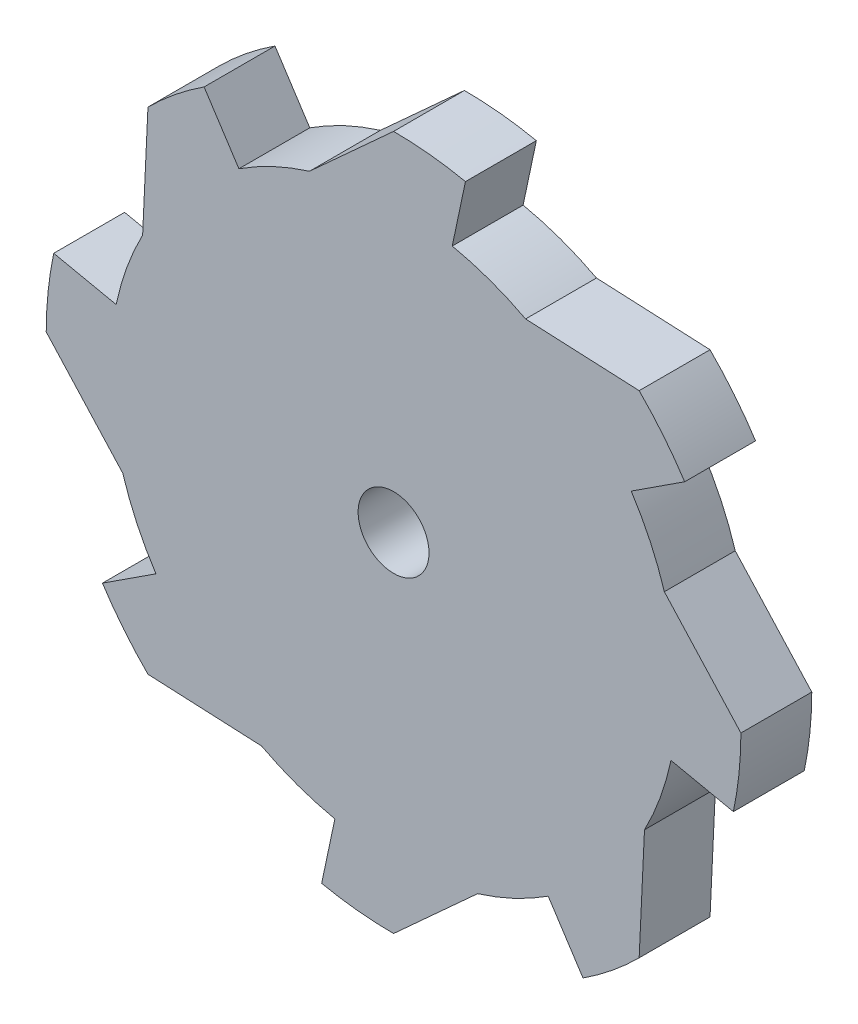
ISO-10303-21;
HEADER;
FILE_DESCRIPTION(('STEP AP214'),'2;1');
FILE_NAME('part.step','',(''),(''),'','','');
FILE_SCHEMA(('AUTOMOTIVE_DESIGN { 1 0 10303 214 1 1 1 1 }'));
ENDSEC;
DATA;
#1=APPLICATION_CONTEXT('core data for automotive mechanical design processes');
#2=APPLICATION_PROTOCOL_DEFINITION('international standard','automotive_design',2000,#1);
#3=PRODUCT_CONTEXT('',#1,'mechanical');
#4=PRODUCT('Part','Part','',(#3));
#5=PRODUCT_RELATED_PRODUCT_CATEGORY('part','',(#4));
#6=PRODUCT_DEFINITION_FORMATION('','',#4);
#7=PRODUCT_DEFINITION_CONTEXT('part definition',#1,'design');
#8=PRODUCT_DEFINITION('design','',#6,#7);
#9=PRODUCT_DEFINITION_SHAPE('','',#8);
#10=(LENGTH_UNIT() NAMED_UNIT(*) SI_UNIT(.MILLI.,.METRE.));
#11=(NAMED_UNIT(*) PLANE_ANGLE_UNIT() SI_UNIT($,.RADIAN.));
#12=(NAMED_UNIT(*) SI_UNIT($,.STERADIAN.) SOLID_ANGLE_UNIT());
#13=UNCERTAINTY_MEASURE_WITH_UNIT(LENGTH_MEASURE(1.E-05),#10,'distance_accuracy_value','');
#14=(GEOMETRIC_REPRESENTATION_CONTEXT(3) GLOBAL_UNCERTAINTY_ASSIGNED_CONTEXT((#13)) GLOBAL_UNIT_ASSIGNED_CONTEXT((#10,
#11,#12)) REPRESENTATION_CONTEXT('',''));
#15=CARTESIAN_POINT('',(0.,0.,0.));
#16=DIRECTION('',(0.,0.,1.));
#17=DIRECTION('',(1.,0.,0.));
#18=AXIS2_PLACEMENT_3D('',#15,#16,#17);
#19=CARTESIAN_POINT('',(0.,0.,20.));
#20=DIRECTION('',(0.,0.,-1.));
#21=DIRECTION('',(-1.,0.,0.));
#22=AXIS2_PLACEMENT_3D('',#19,#20,#21);
#23=CYLINDRICAL_SURFACE('',#22,98.);
#24=CARTESIAN_POINT('',(0.,0.,0.));
#25=DIRECTION('',(0.,0.,1.));
#26=DIRECTION('',(1.,0.,0.));
#27=AXIS2_PLACEMENT_3D('',#24,#25,#26);
#28=CIRCLE('',#27,98.);
#29=CARTESIAN_POINT('',(98.,0.,0.));
#30=VERTEX_POINT('',#29);
#31=CARTESIAN_POINT('',(95.8779684758264,-20.2833715379971,0.));
#32=VERTEX_POINT('',#31);
#33=EDGE_CURVE('E566',#30,#32,#28,.F.);
#34=ORIENTED_EDGE('',*,*,#33,.F.);
#35=DIRECTION('',(0.,0.,-1.));
#36=VECTOR('',#35,1.);
#37=CARTESIAN_POINT('',(98.,0.,20.));
#38=LINE('',#37,#36);
#39=CARTESIAN_POINT('',(98.,0.,20.));
#40=VERTEX_POINT('',#39);
#41=EDGE_CURVE('E11',#40,#30,#38,.T.);
#42=ORIENTED_EDGE('',*,*,#41,.F.);
#43=CARTESIAN_POINT('',(0.,0.,20.));
#44=DIRECTION('',(0.,0.,1.));
#45=DIRECTION('',(1.,0.,0.));
#46=AXIS2_PLACEMENT_3D('',#43,#44,#45);
#47=CIRCLE('',#46,98.);
#48=CARTESIAN_POINT('',(95.8779684758264,-20.2833715379971,20.));
#49=VERTEX_POINT('',#48);
#50=EDGE_CURVE('E567',#40,#49,#47,.F.);
#51=ORIENTED_EDGE('',*,*,#50,.T.);
#52=DIRECTION('',(0.,0.,-1.));
#53=VECTOR('',#52,1.);
#54=CARTESIAN_POINT('',(95.8779684758264,-20.2833715379971,20.));
#55=LINE('',#54,#53);
#56=EDGE_CURVE('E58',#49,#32,#55,.T.);
#57=ORIENTED_EDGE('',*,*,#56,.T.);
#58=EDGE_LOOP('',(#34,#42,#51,#57));
#59=FACE_BOUND('',#58,.T.);
#60=ADVANCED_FACE('F40',(#59),#23,.T.);
#61=CARTESIAN_POINT('',(53.5820749293354,48.7852907067484,20.));
#62=DIRECTION('',(0.739429419637785,0.673234085125024,0.));
#63=DIRECTION('',(-0.673234085125024,0.739429419637785,0.));
#64=AXIS2_PLACEMENT_3D('',#61,#62,#63);
#65=PLANE('',#64);
#66=DIRECTION('',(0.673234085125024,-0.739429419637785,0.));
#67=VECTOR('',#66,1.);
#68=CARTESIAN_POINT('',(53.5820749293354,48.7852907067484,0.));
#69=LINE('',#68,#67);
#70=CARTESIAN_POINT('',(76.4021946540973,23.7213965026815,0.));
#71=VERTEX_POINT('',#70);
#72=EDGE_CURVE('E583',#71,#30,#69,.T.);
#73=ORIENTED_EDGE('',*,*,#72,.F.);
#74=DIRECTION('',(0.,0.,-1.));
#75=VECTOR('',#74,1.);
#76=CARTESIAN_POINT('',(76.4021946540973,23.7213965026815,20.));
#77=LINE('',#76,#75);
#78=CARTESIAN_POINT('',(76.4021946540976,23.7213965026804,20.));
#79=VERTEX_POINT('',#78);
#80=EDGE_CURVE('E50',#79,#71,#77,.T.);
#81=ORIENTED_EDGE('',*,*,#80,.F.);
#82=DIRECTION('',(0.673234085125024,-0.739429419637785,0.));
#83=VECTOR('',#82,1.);
#84=CARTESIAN_POINT('',(53.5820749293354,48.7852907067484,20.));
#85=LINE('',#84,#83);
#86=EDGE_CURVE('E570',#79,#40,#85,.T.);
#87=ORIENTED_EDGE('',*,*,#86,.T.);
#88=ORIENTED_EDGE('',*,*,#41,.T.);
#89=EDGE_LOOP('',(#73,#81,#87,#88));
#90=FACE_BOUND('',#89,.T.);
#91=ADVANCED_FACE('F610',(#90),#65,.T.);
#92=CARTESIAN_POINT('',(0.,0.,20.));
#93=DIRECTION('',(0.,0.,-1.));
#94=DIRECTION('',(-1.,0.,0.));
#95=AXIS2_PLACEMENT_3D('',#92,#93,#94);
#96=CYLINDRICAL_SURFACE('',#95,80.);
#97=CARTESIAN_POINT('',(0.,0.,0.));
#98=DIRECTION('',(0.,0.,1.));
#99=DIRECTION('',(1.,0.,0.));
#100=AXIS2_PLACEMENT_3D('',#97,#98,#99);
#101=CIRCLE('',#100,80.);
#102=CARTESIAN_POINT('',(70.7980702637076,-37.250949611186,0.));
#103=VERTEX_POINT('',#102);
#104=CARTESIAN_POINT('',(78.2677293680216,-16.5578543167324,0.));
#105=VERTEX_POINT('',#104);
#106=EDGE_CURVE('E587',#103,#105,#101,.T.);
#107=ORIENTED_EDGE('',*,*,#106,.T.);
#108=DIRECTION('',(0.,0.,-1.));
#109=VECTOR('',#108,1.);
#110=CARTESIAN_POINT('',(78.2677293680216,-16.5578543167324,20.));
#111=LINE('',#110,#109);
#112=CARTESIAN_POINT('',(78.2677293680216,-16.5578543167324,20.));
#113=VERTEX_POINT('',#112);
#114=EDGE_CURVE('E73',#113,#105,#111,.T.);
#115=ORIENTED_EDGE('',*,*,#114,.F.);
#116=CARTESIAN_POINT('',(0.,0.,20.));
#117=DIRECTION('',(0.,0.,1.));
#118=DIRECTION('',(1.,0.,0.));
#119=AXIS2_PLACEMENT_3D('',#116,#117,#118);
#120=CIRCLE('',#119,80.);
#121=CARTESIAN_POINT('',(70.7980702637076,-37.250949611186,20.));
#122=VERTEX_POINT('',#121);
#123=EDGE_CURVE('E575',#122,#113,#120,.T.);
#124=ORIENTED_EDGE('',*,*,#123,.F.);
#125=DIRECTION('',(0.,0.,-1.));
#126=VECTOR('',#125,1.);
#127=CARTESIAN_POINT('',(70.7980702637076,-37.250949611186,20.));
#128=LINE('',#127,#126);
#129=EDGE_CURVE('E597',#122,#103,#128,.T.);
#130=ORIENTED_EDGE('',*,*,#129,.T.);
#131=EDGE_LOOP('',(#107,#115,#124,#130));
#132=FACE_BOUND('',#131,.T.);
#133=ADVANCED_FACE('F631',(#132),#96,.T.);
#134=CARTESIAN_POINT('',(0.,0.,20.));
#135=DIRECTION('',(-0.206973178959154,-0.97834661710027,0.));
#136=DIRECTION('',(0.97834661710027,-0.206973178959154,0.));
#137=AXIS2_PLACEMENT_3D('',#134,#135,#136);
#138=PLANE('',#137);
#139=DIRECTION('',(-0.97834661710027,0.206973178959154,0.));
#140=VECTOR('',#139,1.);
#141=CARTESIAN_POINT('',(0.,0.,0.));
#142=LINE('',#141,#140);
#143=EDGE_CURVE('E571',#32,#105,#142,.T.);
#144=ORIENTED_EDGE('',*,*,#143,.F.);
#145=ORIENTED_EDGE('',*,*,#56,.F.);
#146=DIRECTION('',(-0.97834661710027,0.206973178959154,0.));
#147=VECTOR('',#146,1.);
#148=CARTESIAN_POINT('',(0.,0.,20.));
#149=LINE('',#148,#147);
#150=EDGE_CURVE('E578',#49,#113,#149,.T.);
#151=ORIENTED_EDGE('',*,*,#150,.T.);
#152=ORIENTED_EDGE('',*,*,#114,.T.);
#153=EDGE_LOOP('',(#144,#145,#151,#152));
#154=FACE_BOUND('',#153,.T.);
#155=ADVANCED_FACE('F635',(#154),#138,.T.);
#156=CARTESIAN_POINT('',(0.,0.,20.));
#157=DIRECTION('',(0.,0.,1.));
#158=DIRECTION('',(1.,0.,0.));
#159=AXIS2_PLACEMENT_3D('',#156,#157,#158);
#160=PLANE('',#159);
#161=CARTESIAN_POINT('',(0.,0.,20.));
#162=DIRECTION('',(0.,0.,1.));
#163=DIRECTION('',(1.,0.,0.));
#164=AXIS2_PLACEMENT_3D('',#161,#162,#163);
#165=CIRCLE('',#164,10.);
#166=CARTESIAN_POINT('',(10.,0.,20.));
#167=VERTEX_POINT('',#166);
#168=EDGE_CURVE('E294',#167,#167,#165,.F.);
#169=ORIENTED_EDGE('',*,*,#168,.T.);
#170=EDGE_LOOP('',(#169));
#171=FACE_BOUND('',#170,.T.);
#172=DIRECTION('',(-0.0468071699168871,-0.998903943752537,0.));
#173=VECTOR('',#172,1.);
#174=CARTESIAN_POINT('',(72.3846584134777,-3.39183865168004,20.));
#175=LINE('',#174,#173);
#176=CARTESIAN_POINT('',(69.2964645562815,-69.2964645562818,20.));
#177=VERTEX_POINT('',#176);
#178=EDGE_CURVE('E527',#122,#177,#175,.T.);
#179=ORIENTED_EDGE('',*,*,#178,.F.);
#180=ORIENTED_EDGE('',*,*,#123,.T.);
#181=ORIENTED_EDGE('',*,*,#150,.F.);
#182=ORIENTED_EDGE('',*,*,#50,.F.);
#183=ORIENTED_EDGE('',*,*,#86,.F.);
#184=CARTESIAN_POINT('',(0.,0.,20.));
#185=DIRECTION('',(0.,0.,1.));
#186=DIRECTION('',(0.707106781186556,0.707106781186539,0.));
#187=AXIS2_PLACEMENT_3D('',#184,#185,#186);
#188=CIRCLE('',#187,80.);
#189=CARTESIAN_POINT('',(67.0518132534625,43.6354711149403,20.));
#190=VERTEX_POINT('',#189);
#191=EDGE_CURVE('E282',#79,#190,#188,.T.);
#192=ORIENTED_EDGE('',*,*,#191,.T.);
#193=DIRECTION('',(-0.838147665668281,-0.545443388936754,0.));
#194=VECTOR('',#193,1.);
#195=CARTESIAN_POINT('',(0.,0.,20.));
#196=LINE('',#195,#194);
#197=CARTESIAN_POINT('',(82.1384712354915,53.4534521158019,20.));
#198=VERTEX_POINT('',#197);
#199=EDGE_CURVE('E274',#198,#190,#196,.T.);
#200=ORIENTED_EDGE('',*,*,#199,.F.);
#201=CARTESIAN_POINT('',(0.,0.,20.));
#202=DIRECTION('',(0.,0.,1.));
#203=DIRECTION('',(0.707106781186556,0.707106781186539,0.));
#204=AXIS2_PLACEMENT_3D('',#201,#202,#203);
#205=CIRCLE('',#204,98.);
#206=CARTESIAN_POINT('',(69.2964645562825,69.2964645562808,20.));
#207=VERTEX_POINT('',#206);
#208=EDGE_CURVE('E256',#207,#198,#205,.F.);
#209=ORIENTED_EDGE('',*,*,#208,.F.);
#210=DIRECTION('',(0.998903943752537,-0.0468071699168974,0.));
#211=VECTOR('',#210,1.);
#212=CARTESIAN_POINT('',(3.39183865168079,72.3846584134776,20.));
#213=LINE('',#212,#211);
#214=CARTESIAN_POINT('',(37.2509496111868,70.7980702637072,20.));
#215=VERTEX_POINT('',#214);
#216=EDGE_CURVE('E272',#215,#207,#213,.T.);
#217=ORIENTED_EDGE('',*,*,#216,.F.);
#218=CARTESIAN_POINT('',(0.,0.,20.));
#219=DIRECTION('',(0.,0.,1.));
#220=DIRECTION('',(0.,1.,0.));
#221=AXIS2_PLACEMENT_3D('',#218,#219,#220);
#222=CIRCLE('',#221,80.);
#223=CARTESIAN_POINT('',(16.5578543167332,78.2677293680214,20.));
#224=VERTEX_POINT('',#223);
#225=EDGE_CURVE('E317',#215,#224,#222,.T.);
#226=ORIENTED_EDGE('',*,*,#225,.T.);
#227=DIRECTION('',(-0.206973178959165,-0.978346617100268,0.));
#228=VECTOR('',#227,1.);
#229=CARTESIAN_POINT('',(0.,0.,20.));
#230=LINE('',#229,#228);
#231=CARTESIAN_POINT('',(20.2833715379981,95.8779684758262,20.));
#232=VERTEX_POINT('',#231);
#233=EDGE_CURVE('E320',#232,#224,#230,.T.);
#234=ORIENTED_EDGE('',*,*,#233,.F.);
#235=CARTESIAN_POINT('',(0.,0.,20.));
#236=DIRECTION('',(0.,0.,1.));
#237=DIRECTION('',(0.,1.,0.));
#238=AXIS2_PLACEMENT_3D('',#235,#236,#237);
#239=CIRCLE('',#238,98.);
#240=CARTESIAN_POINT('',(1.03343440752379E-12,98.,20.));
#241=VERTEX_POINT('',#240);
#242=EDGE_CURVE('E308',#241,#232,#239,.F.);
#243=ORIENTED_EDGE('',*,*,#242,.F.);
#244=DIRECTION('',(0.739429419637792,0.673234085125016,0.));
#245=VECTOR('',#244,1.);
#246=CARTESIAN_POINT('',(-48.7852907067479,53.5820749293359,20.));
#247=LINE('',#246,#245);
#248=CARTESIAN_POINT('',(-23.7213965026806,76.4021946540975,20.));
#249=VERTEX_POINT('',#248);
#250=EDGE_CURVE('E312',#249,#241,#247,.T.);
#251=ORIENTED_EDGE('',*,*,#250,.F.);
#252=CARTESIAN_POINT('',(0.,0.,20.));
#253=DIRECTION('',(0.,0.,1.));
#254=DIRECTION('',(-0.707106781186541,0.707106781186554,0.));
#255=AXIS2_PLACEMENT_3D('',#252,#253,#254);
#256=CIRCLE('',#255,80.);
#257=CARTESIAN_POINT('',(-43.6354711149406,67.0518132534623,20.));
#258=VERTEX_POINT('',#257);
#259=EDGE_CURVE('E359',#249,#258,#256,.T.);
#260=ORIENTED_EDGE('',*,*,#259,.T.);
#261=DIRECTION('',(0.545443388936757,-0.838147665668279,0.));
#262=VECTOR('',#261,1.);
#263=CARTESIAN_POINT('',(0.,0.,20.));
#264=LINE('',#263,#262);
#265=CARTESIAN_POINT('',(-53.4534521158022,82.1384712354913,20.));
#266=VERTEX_POINT('',#265);
#267=EDGE_CURVE('E362',#266,#258,#264,.T.);
#268=ORIENTED_EDGE('',*,*,#267,.F.);
#269=CARTESIAN_POINT('',(0.,0.,20.));
#270=DIRECTION('',(0.,0.,1.));
#271=DIRECTION('',(-0.707106781186541,0.707106781186554,0.));
#272=AXIS2_PLACEMENT_3D('',#269,#270,#271);
#273=CIRCLE('',#272,98.);
#274=CARTESIAN_POINT('',(-69.2964645562811,69.2964645562823,20.));
#275=VERTEX_POINT('',#274);
#276=EDGE_CURVE('E350',#275,#266,#273,.F.);
#277=ORIENTED_EDGE('',*,*,#276,.F.);
#278=DIRECTION('',(0.046807169916894,0.998903943752537,0.));
#279=VECTOR('',#278,1.);
#280=CARTESIAN_POINT('',(-72.3846584134776,3.39183865168054,20.));
#281=LINE('',#280,#279);
#282=CARTESIAN_POINT('',(-70.7980702637076,37.250949611186,20.));
#283=VERTEX_POINT('',#282);
#284=EDGE_CURVE('E354',#283,#275,#281,.T.);
#285=ORIENTED_EDGE('',*,*,#284,.F.);
#286=CARTESIAN_POINT('',(0.,0.,20.));
#287=DIRECTION('',(0.,0.,1.));
#288=DIRECTION('',(-1.,0.,0.));
#289=AXIS2_PLACEMENT_3D('',#286,#287,#288);
#290=CIRCLE('',#289,80.);
#291=CARTESIAN_POINT('',(-78.2677293680216,16.5578543167324,20.));
#292=VERTEX_POINT('',#291);
#293=EDGE_CURVE('E402',#283,#292,#290,.T.);
#294=ORIENTED_EDGE('',*,*,#293,.T.);
#295=DIRECTION('',(0.97834661710027,-0.206973178959154,0.));
#296=VECTOR('',#295,1.);
#297=CARTESIAN_POINT('',(0.,0.,20.));
#298=LINE('',#297,#296);
#299=CARTESIAN_POINT('',(-95.8779684758264,20.2833715379971,20.));
#300=VERTEX_POINT('',#299);
#301=EDGE_CURVE('E405',#300,#292,#298,.T.);
#302=ORIENTED_EDGE('',*,*,#301,.F.);
#303=CARTESIAN_POINT('',(0.,0.,20.));
#304=DIRECTION('',(0.,0.,1.));
#305=DIRECTION('',(-1.,0.,0.));
#306=AXIS2_PLACEMENT_3D('',#303,#304,#305);
#307=CIRCLE('',#306,98.);
#308=CARTESIAN_POINT('',(-98.,0.,20.));
#309=VERTEX_POINT('',#308);
#310=EDGE_CURVE('E393',#309,#300,#307,.F.);
#311=ORIENTED_EDGE('',*,*,#310,.F.);
#312=DIRECTION('',(-0.673234085125024,0.739429419637785,0.));
#313=VECTOR('',#312,1.);
#314=CARTESIAN_POINT('',(-53.5820749293354,-48.7852907067484,20.));
#315=LINE('',#314,#313);
#316=CARTESIAN_POINT('',(-76.4021946540974,-23.7213965026809,20.));
#317=VERTEX_POINT('',#316);
#318=EDGE_CURVE('E397',#317,#309,#315,.T.);
#319=ORIENTED_EDGE('',*,*,#318,.F.);
#320=CARTESIAN_POINT('',(0.,0.,20.));
#321=DIRECTION('',(0.,0.,1.));
#322=DIRECTION('',(-0.707106781186551,-0.707106781186544,0.));
#323=AXIS2_PLACEMENT_3D('',#320,#321,#322);
#324=CIRCLE('',#323,80.);
#325=CARTESIAN_POINT('',(-67.0518132534622,-43.6354711149408,20.));
#326=VERTEX_POINT('',#325);
#327=EDGE_CURVE('E445',#317,#326,#324,.T.);
#328=ORIENTED_EDGE('',*,*,#327,.T.);
#329=DIRECTION('',(0.838147665668277,0.54544338893676,0.));
#330=VECTOR('',#329,1.);
#331=CARTESIAN_POINT('',(0.,0.,20.));
#332=LINE('',#331,#330);
#333=CARTESIAN_POINT('',(-82.1384712354912,-53.4534521158025,20.));
#334=VERTEX_POINT('',#333);
#335=EDGE_CURVE('E448',#334,#326,#332,.T.);
#336=ORIENTED_EDGE('',*,*,#335,.F.);
#337=CARTESIAN_POINT('',(0.,0.,20.));
#338=DIRECTION('',(0.,0.,1.));
#339=DIRECTION('',(-0.707106781186551,-0.707106781186544,0.));
#340=AXIS2_PLACEMENT_3D('',#337,#338,#339);
#341=CIRCLE('',#340,98.);
#342=CARTESIAN_POINT('',(-69.296464556282,-69.2964645562813,20.));
#343=VERTEX_POINT('',#342);
#344=EDGE_CURVE('E436',#343,#334,#341,.F.);
#345=ORIENTED_EDGE('',*,*,#344,.F.);
#346=DIRECTION('',(-0.998903943752537,0.0468071699168906,0.));
#347=VECTOR('',#346,1.);
#348=CARTESIAN_POINT('',(-3.39183865168029,-72.3846584134776,20.));
#349=LINE('',#348,#347);
#350=CARTESIAN_POINT('',(-37.2509496111863,-70.7980702637075,20.));
#351=VERTEX_POINT('',#350);
#352=EDGE_CURVE('E440',#351,#343,#349,.T.);
#353=ORIENTED_EDGE('',*,*,#352,.F.);
#354=CARTESIAN_POINT('',(0.,0.,20.));
#355=DIRECTION('',(0.,0.,1.));
#356=DIRECTION('',(0.,-1.,0.));
#357=AXIS2_PLACEMENT_3D('',#354,#355,#356);
#358=CIRCLE('',#357,80.);
#359=CARTESIAN_POINT('',(-16.5578543167326,-78.2677293680215,20.));
#360=VERTEX_POINT('',#359);
#361=EDGE_CURVE('E488',#351,#360,#358,.T.);
#362=ORIENTED_EDGE('',*,*,#361,.T.);
#363=DIRECTION('',(0.206973178959158,0.978346617100269,0.));
#364=VECTOR('',#363,1.);
#365=CARTESIAN_POINT('',(0.,0.,20.));
#366=LINE('',#365,#364);
#367=CARTESIAN_POINT('',(-20.2833715379975,-95.8779684758264,20.));
#368=VERTEX_POINT('',#367);
#369=EDGE_CURVE('E491',#368,#360,#366,.T.);
#370=ORIENTED_EDGE('',*,*,#369,.F.);
#371=CARTESIAN_POINT('',(0.,0.,20.));
#372=DIRECTION('',(0.,0.,1.));
#373=DIRECTION('',(0.,-1.,0.));
#374=AXIS2_PLACEMENT_3D('',#371,#372,#373);
#375=CIRCLE('',#374,98.);
#376=CARTESIAN_POINT('',(-3.49104065110534E-13,-98.,20.));
#377=VERTEX_POINT('',#376);
#378=EDGE_CURVE('E479',#377,#368,#375,.F.);
#379=ORIENTED_EDGE('',*,*,#378,.F.);
#380=DIRECTION('',(-0.739429419637788,-0.673234085125021,0.));
#381=VECTOR('',#380,1.);
#382=CARTESIAN_POINT('',(48.7852907067482,-53.5820749293356,20.));
#383=LINE('',#382,#381);
#384=CARTESIAN_POINT('',(23.7213965026812,-76.4021946540974,20.));
#385=VERTEX_POINT('',#384);
#386=EDGE_CURVE('E483',#385,#377,#383,.T.);
#387=ORIENTED_EDGE('',*,*,#386,.F.);
#388=CARTESIAN_POINT('',(0.,0.,20.));
#389=DIRECTION('',(0.,0.,1.));
#390=DIRECTION('',(0.707106781186546,-0.707106781186549,0.));
#391=AXIS2_PLACEMENT_3D('',#388,#389,#390);
#392=CIRCLE('',#391,80.);
#393=CARTESIAN_POINT('',(43.635471114941,-67.051813253462,20.));
#394=VERTEX_POINT('',#393);
#395=EDGE_CURVE('E532',#385,#394,#392,.T.);
#396=ORIENTED_EDGE('',*,*,#395,.T.);
#397=DIRECTION('',(-0.545443388936763,0.838147665668276,0.));
#398=VECTOR('',#397,1.);
#399=CARTESIAN_POINT('',(0.,0.,20.));
#400=LINE('',#399,#398);
#401=CARTESIAN_POINT('',(53.4534521158028,-82.138471235491,20.));
#402=VERTEX_POINT('',#401);
#403=EDGE_CURVE('E535',#402,#394,#400,.T.);
#404=ORIENTED_EDGE('',*,*,#403,.F.);
#405=CARTESIAN_POINT('',(0.,0.,20.));
#406=DIRECTION('',(0.,0.,1.));
#407=DIRECTION('',(0.707106781186546,-0.707106781186549,0.));
#408=AXIS2_PLACEMENT_3D('',#405,#406,#407);
#409=CIRCLE('',#408,98.);
#410=EDGE_CURVE('E523',#177,#402,#409,.F.);
#411=ORIENTED_EDGE('',*,*,#410,.F.);
#412=EDGE_LOOP('',(#179,#180,#181,#182,#183,#192,#200,#209,#217,#226,#234,#243,#251,#260,#268,
#277,#285,#294,#302,#311,#319,#328,#336,#345,#353,#362,#370,#379,#387,#396,#404,#411));
#413=FACE_BOUND('',#412,.T.);
#414=ADVANCED_FACE('F271',(#171,#413),#160,.T.);
#415=CARTESIAN_POINT('',(0.,0.,0.));
#416=DIRECTION('',(0.,0.,1.));
#417=DIRECTION('',(1.,0.,0.));
#418=AXIS2_PLACEMENT_3D('',#415,#416,#417);
#419=PLANE('',#418);
#420=CARTESIAN_POINT('',(0.,0.,0.));
#421=DIRECTION('',(0.,0.,1.));
#422=DIRECTION('',(1.,0.,0.));
#423=AXIS2_PLACEMENT_3D('',#420,#421,#422);
#424=CIRCLE('',#423,10.);
#425=CARTESIAN_POINT('',(10.,0.,0.));
#426=VERTEX_POINT('',#425);
#427=EDGE_CURVE('E43',#426,#426,#424,.F.);
#428=ORIENTED_EDGE('',*,*,#427,.F.);
#429=EDGE_LOOP('',(#428));
#430=FACE_BOUND('',#429,.T.);
#431=ORIENTED_EDGE('',*,*,#106,.F.);
#432=DIRECTION('',(-0.0468071699168871,-0.998903943752537,0.));
#433=VECTOR('',#432,1.);
#434=CARTESIAN_POINT('',(72.3846584134777,-3.39183865168004,0.));
#435=LINE('',#434,#433);
#436=CARTESIAN_POINT('',(69.2964645562815,-69.2964645562818,0.));
#437=VERTEX_POINT('',#436);
#438=EDGE_CURVE('E543',#103,#437,#435,.T.);
#439=ORIENTED_EDGE('',*,*,#438,.T.);
#440=CARTESIAN_POINT('',(0.,0.,0.));
#441=DIRECTION('',(0.,0.,1.));
#442=DIRECTION('',(0.707106781186546,-0.707106781186549,0.));
#443=AXIS2_PLACEMENT_3D('',#440,#441,#442);
#444=CIRCLE('',#443,98.);
#445=CARTESIAN_POINT('',(53.4534521158028,-82.138471235491,0.));
#446=VERTEX_POINT('',#445);
#447=EDGE_CURVE('E522',#437,#446,#444,.F.);
#448=ORIENTED_EDGE('',*,*,#447,.T.);
#449=DIRECTION('',(-0.545443388936763,0.838147665668276,0.));
#450=VECTOR('',#449,1.);
#451=CARTESIAN_POINT('',(0.,0.,0.));
#452=LINE('',#451,#450);
#453=CARTESIAN_POINT('',(43.635471114941,-67.051813253462,0.));
#454=VERTEX_POINT('',#453);
#455=EDGE_CURVE('E528',#446,#454,#452,.T.);
#456=ORIENTED_EDGE('',*,*,#455,.T.);
#457=CARTESIAN_POINT('',(0.,0.,0.));
#458=DIRECTION('',(0.,0.,1.));
#459=DIRECTION('',(0.707106781186546,-0.707106781186549,0.));
#460=AXIS2_PLACEMENT_3D('',#457,#458,#459);
#461=CIRCLE('',#460,80.);
#462=CARTESIAN_POINT('',(23.7213965026812,-76.4021946540974,0.));
#463=VERTEX_POINT('',#462);
#464=EDGE_CURVE('E547',#463,#454,#461,.T.);
#465=ORIENTED_EDGE('',*,*,#464,.F.);
#466=DIRECTION('',(-0.739429419637788,-0.673234085125021,0.));
#467=VECTOR('',#466,1.);
#468=CARTESIAN_POINT('',(48.7852907067482,-53.5820749293356,0.));
#469=LINE('',#468,#467);
#470=CARTESIAN_POINT('',(-3.49104065110534E-13,-98.,0.));
#471=VERTEX_POINT('',#470);
#472=EDGE_CURVE('E499',#463,#471,#469,.T.);
#473=ORIENTED_EDGE('',*,*,#472,.T.);
#474=CARTESIAN_POINT('',(0.,0.,0.));
#475=DIRECTION('',(0.,0.,1.));
#476=DIRECTION('',(0.,-1.,0.));
#477=AXIS2_PLACEMENT_3D('',#474,#475,#476);
#478=CIRCLE('',#477,98.);
#479=CARTESIAN_POINT('',(-20.2833715379975,-95.8779684758264,0.));
#480=VERTEX_POINT('',#479);
#481=EDGE_CURVE('E478',#471,#480,#478,.F.);
#482=ORIENTED_EDGE('',*,*,#481,.T.);
#483=DIRECTION('',(0.206973178959158,0.978346617100269,0.));
#484=VECTOR('',#483,1.);
#485=CARTESIAN_POINT('',(0.,0.,0.));
#486=LINE('',#485,#484);
#487=CARTESIAN_POINT('',(-16.5578543167326,-78.2677293680215,0.));
#488=VERTEX_POINT('',#487);
#489=EDGE_CURVE('E484',#480,#488,#486,.T.);
#490=ORIENTED_EDGE('',*,*,#489,.T.);
#491=CARTESIAN_POINT('',(0.,0.,0.));
#492=DIRECTION('',(0.,0.,1.));
#493=DIRECTION('',(0.,-1.,0.));
#494=AXIS2_PLACEMENT_3D('',#491,#492,#493);
#495=CIRCLE('',#494,80.);
#496=CARTESIAN_POINT('',(-37.2509496111862,-70.7980702637075,0.));
#497=VERTEX_POINT('',#496);
#498=EDGE_CURVE('E503',#497,#488,#495,.T.);
#499=ORIENTED_EDGE('',*,*,#498,.F.);
#500=DIRECTION('',(-0.998903943752537,0.0468071699168906,0.));
#501=VECTOR('',#500,1.);
#502=CARTESIAN_POINT('',(-3.39183865168029,-72.3846584134776,0.));
#503=LINE('',#502,#501);
#504=CARTESIAN_POINT('',(-69.296464556282,-69.2964645562813,0.));
#505=VERTEX_POINT('',#504);
#506=EDGE_CURVE('E456',#497,#505,#503,.T.);
#507=ORIENTED_EDGE('',*,*,#506,.T.);
#508=CARTESIAN_POINT('',(0.,0.,0.));
#509=DIRECTION('',(0.,0.,1.));
#510=DIRECTION('',(-0.707106781186551,-0.707106781186544,0.));
#511=AXIS2_PLACEMENT_3D('',#508,#509,#510);
#512=CIRCLE('',#511,98.);
#513=CARTESIAN_POINT('',(-82.1384712354912,-53.4534521158025,0.));
#514=VERTEX_POINT('',#513);
#515=EDGE_CURVE('E435',#505,#514,#512,.F.);
#516=ORIENTED_EDGE('',*,*,#515,.T.);
#517=DIRECTION('',(0.838147665668277,0.54544338893676,0.));
#518=VECTOR('',#517,1.);
#519=CARTESIAN_POINT('',(0.,0.,0.));
#520=LINE('',#519,#518);
#521=CARTESIAN_POINT('',(-67.0518132534622,-43.6354711149408,0.));
#522=VERTEX_POINT('',#521);
#523=EDGE_CURVE('E441',#514,#522,#520,.T.);
#524=ORIENTED_EDGE('',*,*,#523,.T.);
#525=CARTESIAN_POINT('',(0.,0.,0.));
#526=DIRECTION('',(0.,0.,1.));
#527=DIRECTION('',(-0.707106781186551,-0.707106781186544,0.));
#528=AXIS2_PLACEMENT_3D('',#525,#526,#527);
#529=CIRCLE('',#528,80.);
#530=CARTESIAN_POINT('',(-76.4021946540974,-23.7213965026809,0.));
#531=VERTEX_POINT('',#530);
#532=EDGE_CURVE('E460',#531,#522,#529,.T.);
#533=ORIENTED_EDGE('',*,*,#532,.F.);
#534=DIRECTION('',(-0.673234085125024,0.739429419637785,0.));
#535=VECTOR('',#534,1.);
#536=CARTESIAN_POINT('',(-53.5820749293354,-48.7852907067484,0.));
#537=LINE('',#536,#535);
#538=CARTESIAN_POINT('',(-98.,0.,0.));
#539=VERTEX_POINT('',#538);
#540=EDGE_CURVE('E413',#531,#539,#537,.T.);
#541=ORIENTED_EDGE('',*,*,#540,.T.);
#542=CARTESIAN_POINT('',(0.,0.,0.));
#543=DIRECTION('',(0.,0.,1.));
#544=DIRECTION('',(-1.,0.,0.));
#545=AXIS2_PLACEMENT_3D('',#542,#543,#544);
#546=CIRCLE('',#545,98.);
#547=CARTESIAN_POINT('',(-95.8779684758264,20.2833715379971,0.));
#548=VERTEX_POINT('',#547);
#549=EDGE_CURVE('E392',#539,#548,#546,.F.);
#550=ORIENTED_EDGE('',*,*,#549,.T.);
#551=DIRECTION('',(0.97834661710027,-0.206973178959154,0.));
#552=VECTOR('',#551,1.);
#553=CARTESIAN_POINT('',(0.,0.,0.));
#554=LINE('',#553,#552);
#555=CARTESIAN_POINT('',(-78.2677293680216,16.5578543167324,0.));
#556=VERTEX_POINT('',#555);
#557=EDGE_CURVE('E398',#548,#556,#554,.T.);
#558=ORIENTED_EDGE('',*,*,#557,.T.);
#559=CARTESIAN_POINT('',(0.,0.,0.));
#560=DIRECTION('',(0.,0.,1.));
#561=DIRECTION('',(-1.,0.,0.));
#562=AXIS2_PLACEMENT_3D('',#559,#560,#561);
#563=CIRCLE('',#562,80.);
#564=CARTESIAN_POINT('',(-70.7980702637076,37.250949611186,0.));
#565=VERTEX_POINT('',#564);
#566=EDGE_CURVE('E417',#565,#556,#563,.T.);
#567=ORIENTED_EDGE('',*,*,#566,.F.);
#568=DIRECTION('',(0.046807169916894,0.998903943752537,0.));
#569=VECTOR('',#568,1.);
#570=CARTESIAN_POINT('',(-72.3846584134776,3.39183865168054,0.));
#571=LINE('',#570,#569);
#572=CARTESIAN_POINT('',(-69.2964645562811,69.2964645562823,0.));
#573=VERTEX_POINT('',#572);
#574=EDGE_CURVE('E370',#565,#573,#571,.T.);
#575=ORIENTED_EDGE('',*,*,#574,.T.);
#576=CARTESIAN_POINT('',(0.,0.,0.));
#577=DIRECTION('',(0.,0.,1.));
#578=DIRECTION('',(-0.707106781186541,0.707106781186554,0.));
#579=AXIS2_PLACEMENT_3D('',#576,#577,#578);
#580=CIRCLE('',#579,98.);
#581=CARTESIAN_POINT('',(-53.4534521158022,82.1384712354913,0.));
#582=VERTEX_POINT('',#581);
#583=EDGE_CURVE('E349',#573,#582,#580,.F.);
#584=ORIENTED_EDGE('',*,*,#583,.T.);
#585=DIRECTION('',(0.545443388936757,-0.838147665668279,0.));
#586=VECTOR('',#585,1.);
#587=CARTESIAN_POINT('',(0.,0.,0.));
#588=LINE('',#587,#586);
#589=CARTESIAN_POINT('',(-43.6354711149406,67.0518132534623,0.));
#590=VERTEX_POINT('',#589);
#591=EDGE_CURVE('E355',#582,#590,#588,.T.);
#592=ORIENTED_EDGE('',*,*,#591,.T.);
#593=CARTESIAN_POINT('',(0.,0.,0.));
#594=DIRECTION('',(0.,0.,1.));
#595=DIRECTION('',(-0.707106781186541,0.707106781186554,0.));
#596=AXIS2_PLACEMENT_3D('',#593,#594,#595);
#597=CIRCLE('',#596,80.);
#598=CARTESIAN_POINT('',(-23.7213965026806,76.4021946540975,0.));
#599=VERTEX_POINT('',#598);
#600=EDGE_CURVE('E374',#599,#590,#597,.T.);
#601=ORIENTED_EDGE('',*,*,#600,.F.);
#602=DIRECTION('',(0.739429419637792,0.673234085125016,0.));
#603=VECTOR('',#602,1.);
#604=CARTESIAN_POINT('',(-48.7852907067479,53.5820749293359,0.));
#605=LINE('',#604,#603);
#606=CARTESIAN_POINT('',(1.03343440752379E-12,98.,0.));
#607=VERTEX_POINT('',#606);
#608=EDGE_CURVE('E328',#599,#607,#605,.T.);
#609=ORIENTED_EDGE('',*,*,#608,.T.);
#610=CARTESIAN_POINT('',(0.,0.,0.));
#611=DIRECTION('',(0.,0.,1.));
#612=DIRECTION('',(0.,1.,0.));
#613=AXIS2_PLACEMENT_3D('',#610,#611,#612);
#614=CIRCLE('',#613,98.);
#615=CARTESIAN_POINT('',(20.2833715379981,95.8779684758262,0.));
#616=VERTEX_POINT('',#615);
#617=EDGE_CURVE('E265',#607,#616,#614,.F.);
#618=ORIENTED_EDGE('',*,*,#617,.T.);
#619=DIRECTION('',(-0.206973178959165,-0.978346617100268,0.));
#620=VECTOR('',#619,1.);
#621=CARTESIAN_POINT('',(0.,0.,0.));
#622=LINE('',#621,#620);
#623=CARTESIAN_POINT('',(16.5578543167332,78.2677293680214,0.));
#624=VERTEX_POINT('',#623);
#625=EDGE_CURVE('E313',#616,#624,#622,.T.);
#626=ORIENTED_EDGE('',*,*,#625,.T.);
#627=CARTESIAN_POINT('',(0.,0.,0.));
#628=DIRECTION('',(0.,0.,1.));
#629=DIRECTION('',(0.,1.,0.));
#630=AXIS2_PLACEMENT_3D('',#627,#628,#629);
#631=CIRCLE('',#630,80.);
#632=CARTESIAN_POINT('',(37.2509496111868,70.7980702637072,0.));
#633=VERTEX_POINT('',#632);
#634=EDGE_CURVE('E332',#633,#624,#631,.T.);
#635=ORIENTED_EDGE('',*,*,#634,.F.);
#636=DIRECTION('',(0.998903943752537,-0.0468071699168974,0.));
#637=VECTOR('',#636,1.);
#638=CARTESIAN_POINT('',(3.39183865168079,72.3846584134776,0.));
#639=LINE('',#638,#637);
#640=CARTESIAN_POINT('',(69.2964645562825,69.2964645562808,0.));
#641=VERTEX_POINT('',#640);
#642=EDGE_CURVE('E293',#633,#641,#639,.T.);
#643=ORIENTED_EDGE('',*,*,#642,.T.);
#644=CARTESIAN_POINT('',(0.,0.,0.));
#645=DIRECTION('',(0.,0.,1.));
#646=DIRECTION('',(0.707106781186556,0.707106781186539,0.));
#647=AXIS2_PLACEMENT_3D('',#644,#645,#646);
#648=CIRCLE('',#647,98.);
#649=CARTESIAN_POINT('',(82.1384712354915,53.4534521158019,0.));
#650=VERTEX_POINT('',#649);
#651=EDGE_CURVE('E259',#641,#650,#648,.F.);
#652=ORIENTED_EDGE('',*,*,#651,.T.);
#653=DIRECTION('',(-0.838147665668281,-0.545443388936754,0.));
#654=VECTOR('',#653,1.);
#655=CARTESIAN_POINT('',(0.,0.,0.));
#656=LINE('',#655,#654);
#657=CARTESIAN_POINT('',(67.0518132534625,43.6354711149403,0.));
#658=VERTEX_POINT('',#657);
#659=EDGE_CURVE('E276',#650,#658,#656,.T.);
#660=ORIENTED_EDGE('',*,*,#659,.T.);
#661=CARTESIAN_POINT('',(0.,0.,0.));
#662=DIRECTION('',(0.,0.,1.));
#663=DIRECTION('',(0.707106781186556,0.707106781186539,0.));
#664=AXIS2_PLACEMENT_3D('',#661,#662,#663);
#665=CIRCLE('',#664,80.);
#666=EDGE_CURVE('E297',#71,#658,#665,.T.);
#667=ORIENTED_EDGE('',*,*,#666,.F.);
#668=ORIENTED_EDGE('',*,*,#72,.T.);
#669=ORIENTED_EDGE('',*,*,#33,.T.);
#670=ORIENTED_EDGE('',*,*,#143,.T.);
#671=EDGE_LOOP('',(#431,#439,#448,#456,#465,#473,#482,#490,#499,#507,#516,#524,#533,#541,#550,
#558,#567,#575,#584,#592,#601,#609,#618,#626,#635,#643,#652,#660,#667,#668,#669,#670));
#672=FACE_BOUND('',#671,.T.);
#673=ADVANCED_FACE('F613',(#430,#672),#419,.F.);
#674=CARTESIAN_POINT('',(0.,0.,20.));
#675=DIRECTION('',(0.,0.,-1.));
#676=DIRECTION('',(-1.,0.,0.));
#677=AXIS2_PLACEMENT_3D('',#674,#675,#676);
#678=CYLINDRICAL_SURFACE('',#677,98.);
#679=ORIENTED_EDGE('',*,*,#447,.F.);
#680=DIRECTION('',(0.,0.,-1.));
#681=VECTOR('',#680,1.);
#682=CARTESIAN_POINT('',(69.2964645562815,-69.2964645562818,20.));
#683=LINE('',#682,#681);
#684=EDGE_CURVE('E563',#177,#437,#683,.T.);
#685=ORIENTED_EDGE('',*,*,#684,.F.);
#686=ORIENTED_EDGE('',*,*,#410,.T.);
#687=DIRECTION('',(0.,0.,-1.));
#688=VECTOR('',#687,1.);
#689=CARTESIAN_POINT('',(53.4534521158028,-82.138471235491,20.));
#690=LINE('',#689,#688);
#691=EDGE_CURVE('E539',#402,#446,#690,.T.);
#692=ORIENTED_EDGE('',*,*,#691,.T.);
#693=EDGE_LOOP('',(#679,#685,#686,#692));
#694=FACE_BOUND('',#693,.T.);
#695=ADVANCED_FACE('F643',(#694),#678,.T.);
#696=CARTESIAN_POINT('',(72.3846584134777,-3.39183865168004,20.));
#697=DIRECTION('',(0.998903943752537,-0.0468071699168871,0.));
#698=DIRECTION('',(0.0468071699168871,0.998903943752537,0.));
#699=AXIS2_PLACEMENT_3D('',#696,#697,#698);
#700=PLANE('',#699);
#701=ORIENTED_EDGE('',*,*,#438,.F.);
#702=ORIENTED_EDGE('',*,*,#129,.F.);
#703=ORIENTED_EDGE('',*,*,#178,.T.);
#704=ORIENTED_EDGE('',*,*,#684,.T.);
#705=EDGE_LOOP('',(#701,#702,#703,#704));
#706=FACE_BOUND('',#705,.T.);
#707=ADVANCED_FACE('F650',(#706),#700,.T.);
#708=CARTESIAN_POINT('',(0.,0.,20.));
#709=DIRECTION('',(0.,0.,-1.));
#710=DIRECTION('',(-1.,0.,0.));
#711=AXIS2_PLACEMENT_3D('',#708,#709,#710);
#712=CYLINDRICAL_SURFACE('',#711,80.);
#713=ORIENTED_EDGE('',*,*,#464,.T.);
#714=DIRECTION('',(0.,0.,-1.));
#715=VECTOR('',#714,1.);
#716=CARTESIAN_POINT('',(43.635471114941,-67.051813253462,20.));
#717=LINE('',#716,#715);
#718=EDGE_CURVE('E556',#394,#454,#717,.T.);
#719=ORIENTED_EDGE('',*,*,#718,.F.);
#720=ORIENTED_EDGE('',*,*,#395,.F.);
#721=DIRECTION('',(0.,0.,-1.));
#722=VECTOR('',#721,1.);
#723=CARTESIAN_POINT('',(23.7213965026812,-76.4021946540974,20.));
#724=LINE('',#723,#722);
#725=EDGE_CURVE('E559',#385,#463,#724,.T.);
#726=ORIENTED_EDGE('',*,*,#725,.T.);
#727=EDGE_LOOP('',(#713,#719,#720,#726));
#728=FACE_BOUND('',#727,.T.);
#729=ADVANCED_FACE('F654',(#728),#712,.T.);
#730=CARTESIAN_POINT('',(0.,0.,20.));
#731=DIRECTION('',(-0.838147665668275,-0.545443388936763,0.));
#732=DIRECTION('',(0.545443388936763,-0.838147665668275,0.));
#733=AXIS2_PLACEMENT_3D('',#730,#731,#732);
#734=PLANE('',#733);
#735=ORIENTED_EDGE('',*,*,#455,.F.);
#736=ORIENTED_EDGE('',*,*,#691,.F.);
#737=ORIENTED_EDGE('',*,*,#403,.T.);
#738=ORIENTED_EDGE('',*,*,#718,.T.);
#739=EDGE_LOOP('',(#735,#736,#737,#738));
#740=FACE_BOUND('',#739,.T.);
#741=ADVANCED_FACE('F658',(#740),#734,.T.);
#742=CARTESIAN_POINT('',(0.,0.,20.));
#743=DIRECTION('',(0.,0.,-1.));
#744=DIRECTION('',(-1.,0.,0.));
#745=AXIS2_PLACEMENT_3D('',#742,#743,#744);
#746=CYLINDRICAL_SURFACE('',#745,98.);
#747=ORIENTED_EDGE('',*,*,#481,.F.);
#748=DIRECTION('',(0.,0.,-1.));
#749=VECTOR('',#748,1.);
#750=CARTESIAN_POINT('',(-3.49104065110534E-13,-98.,20.));
#751=LINE('',#750,#749);
#752=EDGE_CURVE('E519',#377,#471,#751,.T.);
#753=ORIENTED_EDGE('',*,*,#752,.F.);
#754=ORIENTED_EDGE('',*,*,#378,.T.);
#755=DIRECTION('',(0.,0.,-1.));
#756=VECTOR('',#755,1.);
#757=CARTESIAN_POINT('',(-20.2833715379975,-95.8779684758264,20.));
#758=LINE('',#757,#756);
#759=EDGE_CURVE('E495',#368,#480,#758,.T.);
#760=ORIENTED_EDGE('',*,*,#759,.T.);
#761=EDGE_LOOP('',(#747,#753,#754,#760));
#762=FACE_BOUND('',#761,.T.);
#763=ADVANCED_FACE('F662',(#762),#746,.T.);
#764=CARTESIAN_POINT('',(48.7852907067482,-53.5820749293356,20.));
#765=DIRECTION('',(0.673234085125021,-0.739429419637788,0.));
#766=DIRECTION('',(0.739429419637788,0.673234085125021,0.));
#767=AXIS2_PLACEMENT_3D('',#764,#765,#766);
#768=PLANE('',#767);
#769=ORIENTED_EDGE('',*,*,#472,.F.);
#770=ORIENTED_EDGE('',*,*,#725,.F.);
#771=ORIENTED_EDGE('',*,*,#386,.T.);
#772=ORIENTED_EDGE('',*,*,#752,.T.);
#773=EDGE_LOOP('',(#769,#770,#771,#772));
#774=FACE_BOUND('',#773,.T.);
#775=ADVANCED_FACE('F666',(#774),#768,.T.);
#776=CARTESIAN_POINT('',(0.,0.,20.));
#777=DIRECTION('',(0.,0.,-1.));
#778=DIRECTION('',(-1.,0.,0.));
#779=AXIS2_PLACEMENT_3D('',#776,#777,#778);
#780=CYLINDRICAL_SURFACE('',#779,80.);
#781=ORIENTED_EDGE('',*,*,#498,.T.);
#782=DIRECTION('',(0.,0.,-1.));
#783=VECTOR('',#782,1.);
#784=CARTESIAN_POINT('',(-16.5578543167326,-78.2677293680215,20.));
#785=LINE('',#784,#783);
#786=EDGE_CURVE('E512',#360,#488,#785,.T.);
#787=ORIENTED_EDGE('',*,*,#786,.F.);
#788=ORIENTED_EDGE('',*,*,#361,.F.);
#789=DIRECTION('',(0.,0.,-1.));
#790=VECTOR('',#789,1.);
#791=CARTESIAN_POINT('',(-37.2509496111863,-70.7980702637075,20.));
#792=LINE('',#791,#790);
#793=EDGE_CURVE('E515',#351,#497,#792,.T.);
#794=ORIENTED_EDGE('',*,*,#793,.T.);
#795=EDGE_LOOP('',(#781,#787,#788,#794));
#796=FACE_BOUND('',#795,.T.);
#797=ADVANCED_FACE('F670',(#796),#780,.T.);
#798=CARTESIAN_POINT('',(0.,0.,20.));
#799=DIRECTION('',(-0.978346617100269,0.206973178959158,0.));
#800=DIRECTION('',(-0.206973178959158,-0.978346617100269,0.));
#801=AXIS2_PLACEMENT_3D('',#798,#799,#800);
#802=PLANE('',#801);
#803=ORIENTED_EDGE('',*,*,#489,.F.);
#804=ORIENTED_EDGE('',*,*,#759,.F.);
#805=ORIENTED_EDGE('',*,*,#369,.T.);
#806=ORIENTED_EDGE('',*,*,#786,.T.);
#807=EDGE_LOOP('',(#803,#804,#805,#806));
#808=FACE_BOUND('',#807,.T.);
#809=ADVANCED_FACE('F674',(#808),#802,.T.);
#810=CARTESIAN_POINT('',(0.,0.,20.));
#811=DIRECTION('',(0.,0.,-1.));
#812=DIRECTION('',(-1.,0.,0.));
#813=AXIS2_PLACEMENT_3D('',#810,#811,#812);
#814=CYLINDRICAL_SURFACE('',#813,98.);
#815=ORIENTED_EDGE('',*,*,#515,.F.);
#816=DIRECTION('',(0.,0.,-1.));
#817=VECTOR('',#816,1.);
#818=CARTESIAN_POINT('',(-69.296464556282,-69.2964645562813,20.));
#819=LINE('',#818,#817);
#820=EDGE_CURVE('E475',#343,#505,#819,.T.);
#821=ORIENTED_EDGE('',*,*,#820,.F.);
#822=ORIENTED_EDGE('',*,*,#344,.T.);
#823=DIRECTION('',(0.,0.,-1.));
#824=VECTOR('',#823,1.);
#825=CARTESIAN_POINT('',(-82.1384712354912,-53.4534521158025,20.));
#826=LINE('',#825,#824);
#827=EDGE_CURVE('E452',#334,#514,#826,.T.);
#828=ORIENTED_EDGE('',*,*,#827,.T.);
#829=EDGE_LOOP('',(#815,#821,#822,#828));
#830=FACE_BOUND('',#829,.T.);
#831=ADVANCED_FACE('F678',(#830),#814,.T.);
#832=CARTESIAN_POINT('',(-3.39183865168029,-72.3846584134776,20.));
#833=DIRECTION('',(-0.0468071699168906,-0.998903943752537,0.));
#834=DIRECTION('',(0.998903943752537,-0.0468071699168906,0.));
#835=AXIS2_PLACEMENT_3D('',#832,#833,#834);
#836=PLANE('',#835);
#837=ORIENTED_EDGE('',*,*,#506,.F.);
#838=ORIENTED_EDGE('',*,*,#793,.F.);
#839=ORIENTED_EDGE('',*,*,#352,.T.);
#840=ORIENTED_EDGE('',*,*,#820,.T.);
#841=EDGE_LOOP('',(#837,#838,#839,#840));
#842=FACE_BOUND('',#841,.T.);
#843=ADVANCED_FACE('F682',(#842),#836,.T.);
#844=CARTESIAN_POINT('',(0.,0.,20.));
#845=DIRECTION('',(0.,0.,-1.));
#846=DIRECTION('',(-1.,0.,0.));
#847=AXIS2_PLACEMENT_3D('',#844,#845,#846);
#848=CYLINDRICAL_SURFACE('',#847,80.);
#849=ORIENTED_EDGE('',*,*,#532,.T.);
#850=DIRECTION('',(0.,0.,-1.));
#851=VECTOR('',#850,1.);
#852=CARTESIAN_POINT('',(-67.0518132534622,-43.6354711149408,20.));
#853=LINE('',#852,#851);
#854=EDGE_CURVE('E469',#326,#522,#853,.T.);
#855=ORIENTED_EDGE('',*,*,#854,.F.);
#856=ORIENTED_EDGE('',*,*,#327,.F.);
#857=DIRECTION('',(0.,0.,-1.));
#858=VECTOR('',#857,1.);
#859=CARTESIAN_POINT('',(-76.4021946540974,-23.7213965026809,20.));
#860=LINE('',#859,#858);
#861=EDGE_CURVE('E472',#317,#531,#860,.T.);
#862=ORIENTED_EDGE('',*,*,#861,.T.);
#863=EDGE_LOOP('',(#849,#855,#856,#862));
#864=FACE_BOUND('',#863,.T.);
#865=ADVANCED_FACE('F686',(#864),#848,.T.);
#866=CARTESIAN_POINT('',(0.,0.,20.));
#867=DIRECTION('',(-0.54544338893676,0.838147665668277,0.));
#868=DIRECTION('',(-0.838147665668277,-0.54544338893676,0.));
#869=AXIS2_PLACEMENT_3D('',#866,#867,#868);
#870=PLANE('',#869);
#871=ORIENTED_EDGE('',*,*,#523,.F.);
#872=ORIENTED_EDGE('',*,*,#827,.F.);
#873=ORIENTED_EDGE('',*,*,#335,.T.);
#874=ORIENTED_EDGE('',*,*,#854,.T.);
#875=EDGE_LOOP('',(#871,#872,#873,#874));
#876=FACE_BOUND('',#875,.T.);
#877=ADVANCED_FACE('F690',(#876),#870,.T.);
#878=CARTESIAN_POINT('',(0.,0.,20.));
#879=DIRECTION('',(0.,0.,-1.));
#880=DIRECTION('',(-1.,0.,0.));
#881=AXIS2_PLACEMENT_3D('',#878,#879,#880);
#882=CYLINDRICAL_SURFACE('',#881,98.);
#883=ORIENTED_EDGE('',*,*,#549,.F.);
#884=DIRECTION('',(0.,0.,-1.));
#885=VECTOR('',#884,1.);
#886=CARTESIAN_POINT('',(-98.,0.,20.));
#887=LINE('',#886,#885);
#888=EDGE_CURVE('E432',#309,#539,#887,.T.);
#889=ORIENTED_EDGE('',*,*,#888,.F.);
#890=ORIENTED_EDGE('',*,*,#310,.T.);
#891=DIRECTION('',(0.,0.,-1.));
#892=VECTOR('',#891,1.);
#893=CARTESIAN_POINT('',(-95.8779684758264,20.2833715379971,20.));
#894=LINE('',#893,#892);
#895=EDGE_CURVE('E409',#300,#548,#894,.T.);
#896=ORIENTED_EDGE('',*,*,#895,.T.);
#897=EDGE_LOOP('',(#883,#889,#890,#896));
#898=FACE_BOUND('',#897,.T.);
#899=ADVANCED_FACE('F694',(#898),#882,.T.);
#900=CARTESIAN_POINT('',(-53.5820749293354,-48.7852907067484,20.));
#901=DIRECTION('',(-0.739429419637785,-0.673234085125024,0.));
#902=DIRECTION('',(0.673234085125024,-0.739429419637785,0.));
#903=AXIS2_PLACEMENT_3D('',#900,#901,#902);
#904=PLANE('',#903);
#905=ORIENTED_EDGE('',*,*,#540,.F.);
#906=ORIENTED_EDGE('',*,*,#861,.F.);
#907=ORIENTED_EDGE('',*,*,#318,.T.);
#908=ORIENTED_EDGE('',*,*,#888,.T.);
#909=EDGE_LOOP('',(#905,#906,#907,#908));
#910=FACE_BOUND('',#909,.T.);
#911=ADVANCED_FACE('F698',(#910),#904,.T.);
#912=CARTESIAN_POINT('',(0.,0.,20.));
#913=DIRECTION('',(0.,0.,-1.));
#914=DIRECTION('',(-1.,0.,0.));
#915=AXIS2_PLACEMENT_3D('',#912,#913,#914);
#916=CYLINDRICAL_SURFACE('',#915,80.);
#917=ORIENTED_EDGE('',*,*,#566,.T.);
#918=DIRECTION('',(0.,0.,-1.));
#919=VECTOR('',#918,1.);
#920=CARTESIAN_POINT('',(-78.2677293680216,16.5578543167324,20.));
#921=LINE('',#920,#919);
#922=EDGE_CURVE('E426',#292,#556,#921,.T.);
#923=ORIENTED_EDGE('',*,*,#922,.F.);
#924=ORIENTED_EDGE('',*,*,#293,.F.);
#925=DIRECTION('',(0.,0.,-1.));
#926=VECTOR('',#925,1.);
#927=CARTESIAN_POINT('',(-70.7980702637076,37.250949611186,20.));
#928=LINE('',#927,#926);
#929=EDGE_CURVE('E429',#283,#565,#928,.T.);
#930=ORIENTED_EDGE('',*,*,#929,.T.);
#931=EDGE_LOOP('',(#917,#923,#924,#930));
#932=FACE_BOUND('',#931,.T.);
#933=ADVANCED_FACE('F702',(#932),#916,.T.);
#934=CARTESIAN_POINT('',(0.,0.,20.));
#935=DIRECTION('',(0.206973178959154,0.97834661710027,0.));
#936=DIRECTION('',(-0.97834661710027,0.206973178959154,0.));
#937=AXIS2_PLACEMENT_3D('',#934,#935,#936);
#938=PLANE('',#937);
#939=ORIENTED_EDGE('',*,*,#557,.F.);
#940=ORIENTED_EDGE('',*,*,#895,.F.);
#941=ORIENTED_EDGE('',*,*,#301,.T.);
#942=ORIENTED_EDGE('',*,*,#922,.T.);
#943=EDGE_LOOP('',(#939,#940,#941,#942));
#944=FACE_BOUND('',#943,.T.);
#945=ADVANCED_FACE('F706',(#944),#938,.T.);
#946=CARTESIAN_POINT('',(0.,0.,20.));
#947=DIRECTION('',(0.,0.,-1.));
#948=DIRECTION('',(-1.,0.,0.));
#949=AXIS2_PLACEMENT_3D('',#946,#947,#948);
#950=CYLINDRICAL_SURFACE('',#949,98.);
#951=ORIENTED_EDGE('',*,*,#583,.F.);
#952=DIRECTION('',(0.,0.,-1.));
#953=VECTOR('',#952,1.);
#954=CARTESIAN_POINT('',(-69.2964645562811,69.2964645562823,20.));
#955=LINE('',#954,#953);
#956=EDGE_CURVE('E389',#275,#573,#955,.T.);
#957=ORIENTED_EDGE('',*,*,#956,.F.);
#958=ORIENTED_EDGE('',*,*,#276,.T.);
#959=DIRECTION('',(0.,0.,-1.));
#960=VECTOR('',#959,1.);
#961=CARTESIAN_POINT('',(-53.4534521158022,82.1384712354913,20.));
#962=LINE('',#961,#960);
#963=EDGE_CURVE('E366',#266,#582,#962,.T.);
#964=ORIENTED_EDGE('',*,*,#963,.T.);
#965=EDGE_LOOP('',(#951,#957,#958,#964));
#966=FACE_BOUND('',#965,.T.);
#967=ADVANCED_FACE('F710',(#966),#950,.T.);
#968=CARTESIAN_POINT('',(-72.3846584134776,3.39183865168054,20.));
#969=DIRECTION('',(-0.998903943752537,0.046807169916894,0.));
#970=DIRECTION('',(-0.046807169916894,-0.998903943752537,0.));
#971=AXIS2_PLACEMENT_3D('',#968,#969,#970);
#972=PLANE('',#971);
#973=ORIENTED_EDGE('',*,*,#574,.F.);
#974=ORIENTED_EDGE('',*,*,#929,.F.);
#975=ORIENTED_EDGE('',*,*,#284,.T.);
#976=ORIENTED_EDGE('',*,*,#956,.T.);
#977=EDGE_LOOP('',(#973,#974,#975,#976));
#978=FACE_BOUND('',#977,.T.);
#979=ADVANCED_FACE('F714',(#978),#972,.T.);
#980=CARTESIAN_POINT('',(0.,0.,20.));
#981=DIRECTION('',(0.,0.,-1.));
#982=DIRECTION('',(-1.,0.,0.));
#983=AXIS2_PLACEMENT_3D('',#980,#981,#982);
#984=CYLINDRICAL_SURFACE('',#983,80.);
#985=ORIENTED_EDGE('',*,*,#600,.T.);
#986=DIRECTION('',(0.,0.,-1.));
#987=VECTOR('',#986,1.);
#988=CARTESIAN_POINT('',(-43.6354711149406,67.0518132534623,20.));
#989=LINE('',#988,#987);
#990=EDGE_CURVE('E383',#258,#590,#989,.T.);
#991=ORIENTED_EDGE('',*,*,#990,.F.);
#992=ORIENTED_EDGE('',*,*,#259,.F.);
#993=DIRECTION('',(0.,0.,-1.));
#994=VECTOR('',#993,1.);
#995=CARTESIAN_POINT('',(-23.7213965026806,76.4021946540975,20.));
#996=LINE('',#995,#994);
#997=EDGE_CURVE('E386',#249,#599,#996,.T.);
#998=ORIENTED_EDGE('',*,*,#997,.T.);
#999=EDGE_LOOP('',(#985,#991,#992,#998));
#1000=FACE_BOUND('',#999,.T.);
#1001=ADVANCED_FACE('F718',(#1000),#984,.T.);
#1002=CARTESIAN_POINT('',(0.,0.,20.));
#1003=DIRECTION('',(0.838147665668279,0.545443388936757,0.));
#1004=DIRECTION('',(-0.545443388936757,0.838147665668279,0.));
#1005=AXIS2_PLACEMENT_3D('',#1002,#1003,#1004);
#1006=PLANE('',#1005);
#1007=ORIENTED_EDGE('',*,*,#591,.F.);
#1008=ORIENTED_EDGE('',*,*,#963,.F.);
#1009=ORIENTED_EDGE('',*,*,#267,.T.);
#1010=ORIENTED_EDGE('',*,*,#990,.T.);
#1011=EDGE_LOOP('',(#1007,#1008,#1009,#1010));
#1012=FACE_BOUND('',#1011,.T.);
#1013=ADVANCED_FACE('F722',(#1012),#1006,.T.);
#1014=CARTESIAN_POINT('',(0.,0.,20.));
#1015=DIRECTION('',(0.,0.,-1.));
#1016=DIRECTION('',(-1.,0.,0.));
#1017=AXIS2_PLACEMENT_3D('',#1014,#1015,#1016);
#1018=CYLINDRICAL_SURFACE('',#1017,98.);
#1019=ORIENTED_EDGE('',*,*,#617,.F.);
#1020=DIRECTION('',(0.,0.,-1.));
#1021=VECTOR('',#1020,1.);
#1022=CARTESIAN_POINT('',(1.03343440752379E-12,98.,20.));
#1023=LINE('',#1022,#1021);
#1024=EDGE_CURVE('E346',#241,#607,#1023,.T.);
#1025=ORIENTED_EDGE('',*,*,#1024,.F.);
#1026=ORIENTED_EDGE('',*,*,#242,.T.);
#1027=DIRECTION('',(0.,0.,-1.));
#1028=VECTOR('',#1027,1.);
#1029=CARTESIAN_POINT('',(20.2833715379981,95.8779684758262,20.));
#1030=LINE('',#1029,#1028);
#1031=EDGE_CURVE('E324',#232,#616,#1030,.T.);
#1032=ORIENTED_EDGE('',*,*,#1031,.T.);
#1033=EDGE_LOOP('',(#1019,#1025,#1026,#1032));
#1034=FACE_BOUND('',#1033,.T.);
#1035=ADVANCED_FACE('F726',(#1034),#1018,.T.);
#1036=CARTESIAN_POINT('',(-48.7852907067479,53.5820749293359,20.));
#1037=DIRECTION('',(-0.673234085125016,0.739429419637792,0.));
#1038=DIRECTION('',(-0.739429419637792,-0.673234085125016,0.));
#1039=AXIS2_PLACEMENT_3D('',#1036,#1037,#1038);
#1040=PLANE('',#1039);
#1041=ORIENTED_EDGE('',*,*,#608,.F.);
#1042=ORIENTED_EDGE('',*,*,#997,.F.);
#1043=ORIENTED_EDGE('',*,*,#250,.T.);
#1044=ORIENTED_EDGE('',*,*,#1024,.T.);
#1045=EDGE_LOOP('',(#1041,#1042,#1043,#1044));
#1046=FACE_BOUND('',#1045,.T.);
#1047=ADVANCED_FACE('F730',(#1046),#1040,.T.);
#1048=CARTESIAN_POINT('',(0.,0.,20.));
#1049=DIRECTION('',(0.,0.,-1.));
#1050=DIRECTION('',(-1.,0.,0.));
#1051=AXIS2_PLACEMENT_3D('',#1048,#1049,#1050);
#1052=CYLINDRICAL_SURFACE('',#1051,80.);
#1053=ORIENTED_EDGE('',*,*,#634,.T.);
#1054=DIRECTION('',(0.,0.,-1.));
#1055=VECTOR('',#1054,1.);
#1056=CARTESIAN_POINT('',(16.5578543167332,78.2677293680214,20.));
#1057=LINE('',#1056,#1055);
#1058=EDGE_CURVE('E341',#224,#624,#1057,.T.);
#1059=ORIENTED_EDGE('',*,*,#1058,.F.);
#1060=ORIENTED_EDGE('',*,*,#225,.F.);
#1061=DIRECTION('',(0.,0.,-1.));
#1062=VECTOR('',#1061,1.);
#1063=CARTESIAN_POINT('',(37.2509496111868,70.7980702637072,20.));
#1064=LINE('',#1063,#1062);
#1065=EDGE_CURVE('E280',#215,#633,#1064,.T.);
#1066=ORIENTED_EDGE('',*,*,#1065,.T.);
#1067=EDGE_LOOP('',(#1053,#1059,#1060,#1066));
#1068=FACE_BOUND('',#1067,.T.);
#1069=ADVANCED_FACE('F734',(#1068),#1052,.T.);
#1070=CARTESIAN_POINT('',(0.,0.,20.));
#1071=DIRECTION('',(0.978346617100268,-0.206973178959165,0.));
#1072=DIRECTION('',(0.206973178959165,0.978346617100268,0.));
#1073=AXIS2_PLACEMENT_3D('',#1070,#1071,#1072);
#1074=PLANE('',#1073);
#1075=ORIENTED_EDGE('',*,*,#625,.F.);
#1076=ORIENTED_EDGE('',*,*,#1031,.F.);
#1077=ORIENTED_EDGE('',*,*,#233,.T.);
#1078=ORIENTED_EDGE('',*,*,#1058,.T.);
#1079=EDGE_LOOP('',(#1075,#1076,#1077,#1078));
#1080=FACE_BOUND('',#1079,.T.);
#1081=ADVANCED_FACE('F738',(#1080),#1074,.T.);
#1082=CARTESIAN_POINT('',(0.,0.,20.));
#1083=DIRECTION('',(0.,0.,-1.));
#1084=DIRECTION('',(-1.,0.,0.));
#1085=AXIS2_PLACEMENT_3D('',#1082,#1083,#1084);
#1086=CYLINDRICAL_SURFACE('',#1085,98.);
#1087=ORIENTED_EDGE('',*,*,#651,.F.);
#1088=DIRECTION('',(0.,0.,-1.));
#1089=VECTOR('',#1088,1.);
#1090=CARTESIAN_POINT('',(69.2964645562825,69.2964645562808,20.));
#1091=LINE('',#1090,#1089);
#1092=EDGE_CURVE('E253',#207,#641,#1091,.T.);
#1093=ORIENTED_EDGE('',*,*,#1092,.F.);
#1094=ORIENTED_EDGE('',*,*,#208,.T.);
#1095=DIRECTION('',(0.,0.,-1.));
#1096=VECTOR('',#1095,1.);
#1097=CARTESIAN_POINT('',(82.1384712354915,53.4534521158019,20.));
#1098=LINE('',#1097,#1096);
#1099=EDGE_CURVE('E290',#198,#650,#1098,.T.);
#1100=ORIENTED_EDGE('',*,*,#1099,.T.);
#1101=EDGE_LOOP('',(#1087,#1093,#1094,#1100));
#1102=FACE_BOUND('',#1101,.T.);
#1103=ADVANCED_FACE('F255',(#1102),#1086,.T.);
#1104=CARTESIAN_POINT('',(3.39183865168079,72.3846584134776,20.));
#1105=DIRECTION('',(0.0468071699168974,0.998903943752537,0.));
#1106=DIRECTION('',(-0.998903943752537,0.0468071699168974,0.));
#1107=AXIS2_PLACEMENT_3D('',#1104,#1105,#1106);
#1108=PLANE('',#1107);
#1109=ORIENTED_EDGE('',*,*,#642,.F.);
#1110=ORIENTED_EDGE('',*,*,#1065,.F.);
#1111=ORIENTED_EDGE('',*,*,#216,.T.);
#1112=ORIENTED_EDGE('',*,*,#1092,.T.);
#1113=EDGE_LOOP('',(#1109,#1110,#1111,#1112));
#1114=FACE_BOUND('',#1113,.T.);
#1115=ADVANCED_FACE('F279',(#1114),#1108,.T.);
#1116=CARTESIAN_POINT('',(0.,0.,20.));
#1117=DIRECTION('',(0.,0.,-1.));
#1118=DIRECTION('',(-1.,0.,0.));
#1119=AXIS2_PLACEMENT_3D('',#1116,#1117,#1118);
#1120=CYLINDRICAL_SURFACE('',#1119,80.);
#1121=ORIENTED_EDGE('',*,*,#666,.T.);
#1122=DIRECTION('',(0.,0.,-1.));
#1123=VECTOR('',#1122,1.);
#1124=CARTESIAN_POINT('',(67.0518132534625,43.6354711149403,20.));
#1125=LINE('',#1124,#1123);
#1126=EDGE_CURVE('E266',#190,#658,#1125,.T.);
#1127=ORIENTED_EDGE('',*,*,#1126,.F.);
#1128=ORIENTED_EDGE('',*,*,#191,.F.);
#1129=ORIENTED_EDGE('',*,*,#80,.T.);
#1130=EDGE_LOOP('',(#1121,#1127,#1128,#1129));
#1131=FACE_BOUND('',#1130,.T.);
#1132=ADVANCED_FACE('F606',(#1131),#1120,.T.);
#1133=CARTESIAN_POINT('',(0.,0.,20.));
#1134=DIRECTION('',(0.545443388936754,-0.838147665668281,0.));
#1135=DIRECTION('',(0.838147665668281,0.545443388936754,0.));
#1136=AXIS2_PLACEMENT_3D('',#1133,#1134,#1135);
#1137=PLANE('',#1136);
#1138=ORIENTED_EDGE('',*,*,#659,.F.);
#1139=ORIENTED_EDGE('',*,*,#1099,.F.);
#1140=ORIENTED_EDGE('',*,*,#199,.T.);
#1141=ORIENTED_EDGE('',*,*,#1126,.T.);
#1142=EDGE_LOOP('',(#1138,#1139,#1140,#1141));
#1143=FACE_BOUND('',#1142,.T.);
#1144=ADVANCED_FACE('F616',(#1143),#1137,.T.);
#1145=CARTESIAN_POINT('',(0.,0.,67.6623462612014));
#1146=DIRECTION('',(0.,0.,-1.));
#1147=DIRECTION('',(-1.,0.,0.));
#1148=AXIS2_PLACEMENT_3D('',#1145,#1146,#1147);
#1149=CYLINDRICAL_SURFACE('',#1148,10.);
#1150=ORIENTED_EDGE('',*,*,#168,.F.);
#1151=EDGE_LOOP('',(#1150));
#1152=FACE_BOUND('',#1151,.T.);
#1153=ORIENTED_EDGE('',*,*,#427,.T.);
#1154=EDGE_LOOP('',(#1153));
#1155=FACE_BOUND('',#1154,.T.);
#1156=ADVANCED_FACE('F618',(#1152,#1155),#1149,.F.);
#1157=CLOSED_SHELL('',(#60,#91,#133,#155,#414,#673,#695,#707,#729,#741,#763,#775,#797,#809,#831,
#843,#865,#877,#899,#911,#933,#945,#967,#979,#1001,#1013,#1035,#1047,#1069,#1081,#1103,#1115,
#1132,#1144,#1156));
#1158=MANIFOLD_SOLID_BREP('B2',#1157);
#1159=ADVANCED_BREP_SHAPE_REPRESENTATION('',(#18,#1158),#14);
#1160=SHAPE_DEFINITION_REPRESENTATION(#9,#1159);
ENDSEC;
END-ISO-10303-21;
